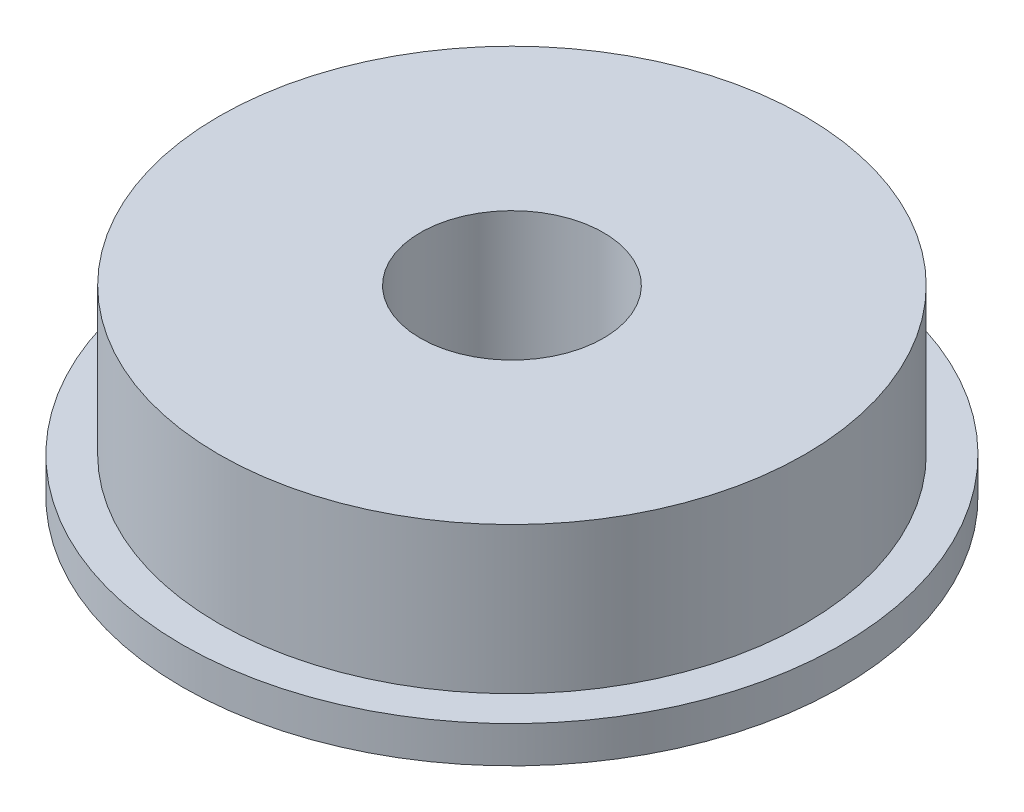
ISO-10303-21;
HEADER;
FILE_DESCRIPTION(('STEP AP214'),'2;1');
FILE_NAME('part.step','',(''),(''),'','','');
FILE_SCHEMA(('AUTOMOTIVE_DESIGN { 1 0 10303 214 1 1 1 1 }'));
ENDSEC;
DATA;
#1=APPLICATION_CONTEXT('core data for automotive mechanical design processes');
#2=APPLICATION_PROTOCOL_DEFINITION('international standard','automotive_design',2000,#1);
#3=PRODUCT_CONTEXT('',#1,'mechanical');
#4=PRODUCT('Part','Part','',(#3));
#5=PRODUCT_RELATED_PRODUCT_CATEGORY('part','',(#4));
#6=PRODUCT_DEFINITION_FORMATION('','',#4);
#7=PRODUCT_DEFINITION_CONTEXT('part definition',#1,'design');
#8=PRODUCT_DEFINITION('design','',#6,#7);
#9=PRODUCT_DEFINITION_SHAPE('','',#8);
#10=(LENGTH_UNIT() NAMED_UNIT(*) SI_UNIT(.MILLI.,.METRE.));
#11=(NAMED_UNIT(*) PLANE_ANGLE_UNIT() SI_UNIT($,.RADIAN.));
#12=(NAMED_UNIT(*) SI_UNIT($,.STERADIAN.) SOLID_ANGLE_UNIT());
#13=UNCERTAINTY_MEASURE_WITH_UNIT(LENGTH_MEASURE(1.E-05),#10,'distance_accuracy_value','');
#14=(GEOMETRIC_REPRESENTATION_CONTEXT(3) GLOBAL_UNCERTAINTY_ASSIGNED_CONTEXT((#13)) GLOBAL_UNIT_ASSIGNED_CONTEXT((#10,
#11,#12)) REPRESENTATION_CONTEXT('',''));
#15=CARTESIAN_POINT('',(0.,0.,0.));
#16=DIRECTION('',(0.,0.,1.));
#17=DIRECTION('',(1.,0.,0.));
#18=AXIS2_PLACEMENT_3D('',#15,#16,#17);
#19=CARTESIAN_POINT('',(0.,17.721586263287,0.));
#20=DIRECTION('',(0.,-1.,0.));
#21=DIRECTION('',(0.,0.,-1.));
#22=AXIS2_PLACEMENT_3D('',#19,#20,#21);
#23=CYLINDRICAL_SURFACE('',#22,9.);
#24=CARTESIAN_POINT('',(0.,17.721586263287,0.));
#25=DIRECTION('',(0.,1.,0.));
#26=DIRECTION('',(0.,0.,1.));
#27=AXIS2_PLACEMENT_3D('',#24,#25,#26);
#28=CIRCLE('',#27,9.);
#29=CARTESIAN_POINT('',(0.,17.721586263287,9.));
#30=VERTEX_POINT('',#29);
#31=EDGE_CURVE('E41',#30,#30,#28,.T.);
#32=ORIENTED_EDGE('',*,*,#31,.F.);
#33=EDGE_LOOP('',(#32));
#34=FACE_BOUND('',#33,.T.);
#35=CARTESIAN_POINT('',(0.,16.721586263287,0.));
#36=DIRECTION('',(0.,1.,0.));
#37=DIRECTION('',(0.,0.,1.));
#38=AXIS2_PLACEMENT_3D('',#35,#36,#37);
#39=CIRCLE('',#38,9.);
#40=CARTESIAN_POINT('',(0.,16.721586263287,9.));
#41=VERTEX_POINT('',#40);
#42=EDGE_CURVE('E37',#41,#41,#39,.T.);
#43=ORIENTED_EDGE('',*,*,#42,.T.);
#44=EDGE_LOOP('',(#43));
#45=FACE_BOUND('',#44,.T.);
#46=ADVANCED_FACE('F34',(#34,#45),#23,.T.);
#47=CARTESIAN_POINT('',(0.,17.721586263287,0.));
#48=DIRECTION('',(0.,1.,0.));
#49=DIRECTION('',(0.,0.,1.));
#50=AXIS2_PLACEMENT_3D('',#47,#48,#49);
#51=PLANE('',#50);
#52=CARTESIAN_POINT('',(0.,17.721586263287,0.));
#53=DIRECTION('',(0.,1.,0.));
#54=DIRECTION('',(0.,0.,1.));
#55=AXIS2_PLACEMENT_3D('',#52,#53,#54);
#56=CIRCLE('',#55,8.);
#57=CARTESIAN_POINT('',(0.,17.721586263287,8.));
#58=VERTEX_POINT('',#57);
#59=EDGE_CURVE('E10',#58,#58,#56,.T.);
#60=ORIENTED_EDGE('',*,*,#59,.F.);
#61=EDGE_LOOP('',(#60));
#62=FACE_BOUND('',#61,.T.);
#63=ORIENTED_EDGE('',*,*,#31,.T.);
#64=EDGE_LOOP('',(#63));
#65=FACE_BOUND('',#64,.T.);
#66=ADVANCED_FACE('F78',(#62,#65),#51,.T.);
#67=CARTESIAN_POINT('',(0.,16.721586263287,0.));
#68=DIRECTION('',(0.,1.,0.));
#69=DIRECTION('',(0.,0.,1.));
#70=AXIS2_PLACEMENT_3D('',#67,#68,#69);
#71=PLANE('',#70);
#72=CARTESIAN_POINT('',(0.,16.721586263287,0.));
#73=DIRECTION('',(0.,1.,0.));
#74=DIRECTION('',(0.,0.,1.));
#75=AXIS2_PLACEMENT_3D('',#72,#73,#74);
#76=CIRCLE('',#75,2.5);
#77=CARTESIAN_POINT('',(0.,16.721586263287,2.5));
#78=VERTEX_POINT('',#77);
#79=EDGE_CURVE('E50',#78,#78,#76,.T.);
#80=ORIENTED_EDGE('',*,*,#79,.T.);
#81=EDGE_LOOP('',(#80));
#82=FACE_BOUND('',#81,.T.);
#83=ORIENTED_EDGE('',*,*,#42,.F.);
#84=EDGE_LOOP('',(#83));
#85=FACE_BOUND('',#84,.T.);
#86=ADVANCED_FACE('F57',(#82,#85),#71,.F.);
#87=CARTESIAN_POINT('',(0.,21.721586263287,0.));
#88=DIRECTION('',(0.,-1.,0.));
#89=DIRECTION('',(0.,0.,-1.));
#90=AXIS2_PLACEMENT_3D('',#87,#88,#89);
#91=CYLINDRICAL_SURFACE('',#90,8.);
#92=CARTESIAN_POINT('',(0.,21.721586263287,0.));
#93=DIRECTION('',(0.,1.,0.));
#94=DIRECTION('',(0.,0.,1.));
#95=AXIS2_PLACEMENT_3D('',#92,#93,#94);
#96=CIRCLE('',#95,8.);
#97=CARTESIAN_POINT('',(0.,21.721586263287,8.));
#98=VERTEX_POINT('',#97);
#99=EDGE_CURVE('E47',#98,#98,#96,.T.);
#100=ORIENTED_EDGE('',*,*,#99,.F.);
#101=EDGE_LOOP('',(#100));
#102=FACE_BOUND('',#101,.T.);
#103=ORIENTED_EDGE('',*,*,#59,.T.);
#104=EDGE_LOOP('',(#103));
#105=FACE_BOUND('',#104,.T.);
#106=ADVANCED_FACE('F69',(#102,#105),#91,.T.);
#107=CARTESIAN_POINT('',(0.,21.721586263287,0.));
#108=DIRECTION('',(0.,1.,0.));
#109=DIRECTION('',(0.,0.,1.));
#110=AXIS2_PLACEMENT_3D('',#107,#108,#109);
#111=PLANE('',#110);
#112=CARTESIAN_POINT('',(0.,21.721586263287,0.));
#113=DIRECTION('',(0.,1.,0.));
#114=DIRECTION('',(0.,0.,1.));
#115=AXIS2_PLACEMENT_3D('',#112,#113,#114);
#116=CIRCLE('',#115,2.5);
#117=CARTESIAN_POINT('',(0.,21.721586263287,2.5));
#118=VERTEX_POINT('',#117);
#119=EDGE_CURVE('E51',#118,#118,#116,.T.);
#120=ORIENTED_EDGE('',*,*,#119,.F.);
#121=EDGE_LOOP('',(#120));
#122=FACE_BOUND('',#121,.T.);
#123=ORIENTED_EDGE('',*,*,#99,.T.);
#124=EDGE_LOOP('',(#123));
#125=FACE_BOUND('',#124,.T.);
#126=ADVANCED_FACE('F63',(#122,#125),#111,.T.);
#127=CARTESIAN_POINT('',(0.,16.721586263287,0.));
#128=DIRECTION('',(0.,1.,0.));
#129=DIRECTION('',(0.,0.,1.));
#130=AXIS2_PLACEMENT_3D('',#127,#128,#129);
#131=CYLINDRICAL_SURFACE('',#130,2.5);
#132=ORIENTED_EDGE('',*,*,#79,.F.);
#133=EDGE_LOOP('',(#132));
#134=FACE_BOUND('',#133,.T.);
#135=ORIENTED_EDGE('',*,*,#119,.T.);
#136=EDGE_LOOP('',(#135));
#137=FACE_BOUND('',#136,.T.);
#138=ADVANCED_FACE('F60',(#134,#137),#131,.F.);
#139=CLOSED_SHELL('',(#46,#66,#86,#106,#126,#138));
#140=MANIFOLD_SOLID_BREP('B2',#139);
#141=ADVANCED_BREP_SHAPE_REPRESENTATION('',(#18,#140),#14);
#142=SHAPE_DEFINITION_REPRESENTATION(#9,#141);
ENDSEC;
END-ISO-10303-21;
